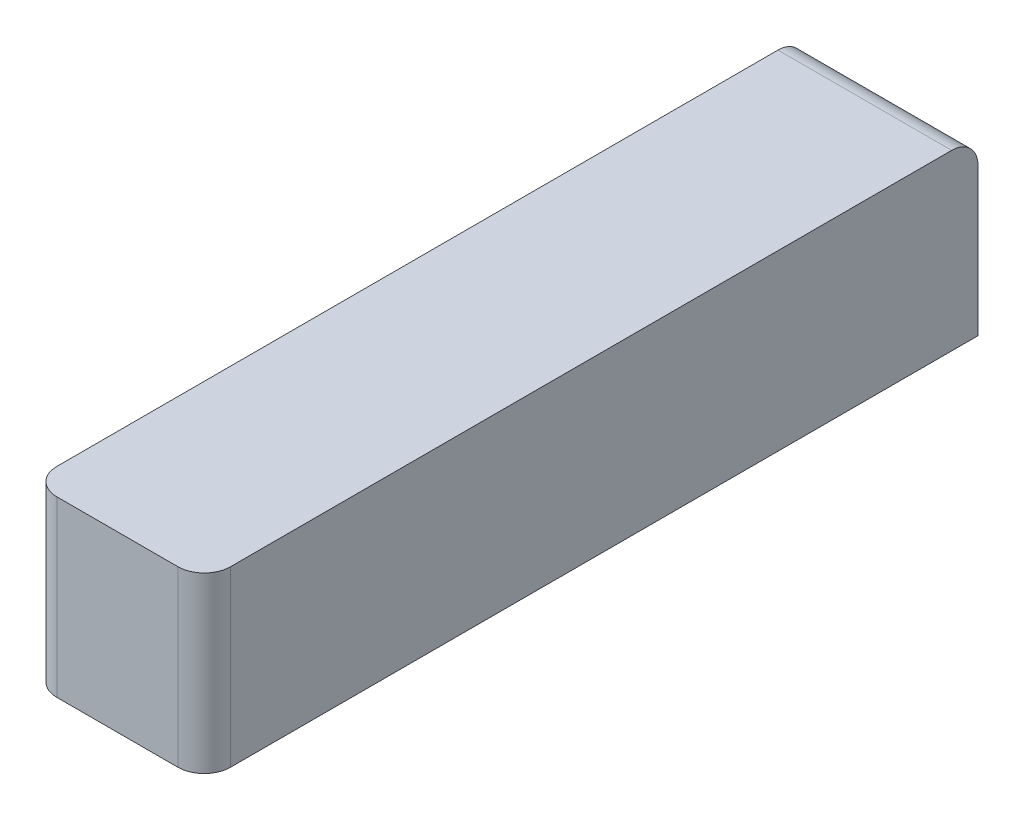
ISO-10303-21;
HEADER;
FILE_DESCRIPTION(('STEP AP214'),'2;1');
FILE_NAME('part.step','',(''),(''),'','','');
FILE_SCHEMA(('AUTOMOTIVE_DESIGN { 1 0 10303 214 1 1 1 1 }'));
ENDSEC;
DATA;
#1=APPLICATION_CONTEXT('core data for automotive mechanical design processes');
#2=APPLICATION_PROTOCOL_DEFINITION('international standard','automotive_design',2000,#1);
#3=PRODUCT_CONTEXT('',#1,'mechanical');
#4=PRODUCT('Part','Part','',(#3));
#5=PRODUCT_RELATED_PRODUCT_CATEGORY('part','',(#4));
#6=PRODUCT_DEFINITION_FORMATION('','',#4);
#7=PRODUCT_DEFINITION_CONTEXT('part definition',#1,'design');
#8=PRODUCT_DEFINITION('design','',#6,#7);
#9=PRODUCT_DEFINITION_SHAPE('','',#8);
#10=(LENGTH_UNIT() NAMED_UNIT(*) SI_UNIT(.MILLI.,.METRE.));
#11=(NAMED_UNIT(*) PLANE_ANGLE_UNIT() SI_UNIT($,.RADIAN.));
#12=(NAMED_UNIT(*) SI_UNIT($,.STERADIAN.) SOLID_ANGLE_UNIT());
#13=UNCERTAINTY_MEASURE_WITH_UNIT(LENGTH_MEASURE(1.E-05),#10,'distance_accuracy_value','');
#14=(GEOMETRIC_REPRESENTATION_CONTEXT(3) GLOBAL_UNCERTAINTY_ASSIGNED_CONTEXT((#13)) GLOBAL_UNIT_ASSIGNED_CONTEXT((#10,
#11,#12)) REPRESENTATION_CONTEXT('',''));
#15=CARTESIAN_POINT('',(0.,0.,0.));
#16=DIRECTION('',(0.,0.,1.));
#17=DIRECTION('',(1.,0.,0.));
#18=AXIS2_PLACEMENT_3D('',#15,#16,#17);
#19=CARTESIAN_POINT('',(16.5,33.,73.5));
#20=DIRECTION('',(-1.,0.,0.));
#21=DIRECTION('',(0.,0.,1.));
#22=AXIS2_PLACEMENT_3D('',#19,#20,#21);
#23=PLANE('',#22);
#24=DIRECTION('',(0.,-1.,0.));
#25=VECTOR('',#24,1.);
#26=CARTESIAN_POINT('',(16.5,33.,-73.5));
#27=LINE('',#26,#25);
#28=CARTESIAN_POINT('',(16.5,28.,-73.5));
#29=VERTEX_POINT('',#28);
#30=CARTESIAN_POINT('',(16.5,0.,-73.5));
#31=VERTEX_POINT('',#30);
#32=EDGE_CURVE('E97',#29,#31,#27,.T.);
#33=ORIENTED_EDGE('',*,*,#32,.F.);
#34=CARTESIAN_POINT('',(16.5,28.,-68.5));
#35=DIRECTION('',(-1.,0.,0.));
#36=DIRECTION('',(0.,0.,1.));
#37=AXIS2_PLACEMENT_3D('',#34,#35,#36);
#38=CIRCLE('',#37,5.);
#39=CARTESIAN_POINT('',(16.5,33.,-68.5));
#40=VERTEX_POINT('',#39);
#41=EDGE_CURVE('E139',#29,#40,#38,.F.);
#42=ORIENTED_EDGE('',*,*,#41,.T.);
#43=DIRECTION('',(0.,0.,-1.));
#44=VECTOR('',#43,1.);
#45=CARTESIAN_POINT('',(16.5,33.,73.5));
#46=LINE('',#45,#44);
#47=CARTESIAN_POINT('',(16.5,33.,68.5));
#48=VERTEX_POINT('',#47);
#49=EDGE_CURVE('E124',#48,#40,#46,.T.);
#50=ORIENTED_EDGE('',*,*,#49,.F.);
#51=DIRECTION('',(0.,-1.,0.));
#52=VECTOR('',#51,1.);
#53=CARTESIAN_POINT('',(16.5,33.,68.5));
#54=LINE('',#53,#52);
#55=CARTESIAN_POINT('',(16.5,0.,68.5));
#56=VERTEX_POINT('',#55);
#57=EDGE_CURVE('E101',#48,#56,#54,.T.);
#58=ORIENTED_EDGE('',*,*,#57,.T.);
#59=DIRECTION('',(0.,0.,-1.));
#60=VECTOR('',#59,1.);
#61=CARTESIAN_POINT('',(16.5,0.,73.5));
#62=LINE('',#61,#60);
#63=EDGE_CURVE('E95',#56,#31,#62,.T.);
#64=ORIENTED_EDGE('',*,*,#63,.T.);
#65=EDGE_LOOP('',(#33,#42,#50,#58,#64));
#66=FACE_BOUND('',#65,.T.);
#67=ADVANCED_FACE('F37',(#66),#23,.F.);
#68=CARTESIAN_POINT('',(-16.5,33.,-73.5));
#69=DIRECTION('',(0.,0.,1.));
#70=DIRECTION('',(1.,0.,0.));
#71=AXIS2_PLACEMENT_3D('',#68,#69,#70);
#72=PLANE('',#71);
#73=DIRECTION('',(0.,-1.,0.));
#74=VECTOR('',#73,1.);
#75=CARTESIAN_POINT('',(-16.5,33.,-73.5));
#76=LINE('',#75,#74);
#77=CARTESIAN_POINT('',(-16.5,28.,-73.5));
#78=VERTEX_POINT('',#77);
#79=CARTESIAN_POINT('',(-16.5,0.,-73.5));
#80=VERTEX_POINT('',#79);
#81=EDGE_CURVE('E113',#78,#80,#76,.T.);
#82=ORIENTED_EDGE('',*,*,#81,.F.);
#83=DIRECTION('',(-1.,0.,0.));
#84=VECTOR('',#83,1.);
#85=CARTESIAN_POINT('',(-16.5,28.,-73.5));
#86=LINE('',#85,#84);
#87=EDGE_CURVE('E111',#78,#29,#86,.F.);
#88=ORIENTED_EDGE('',*,*,#87,.T.);
#89=ORIENTED_EDGE('',*,*,#32,.T.);
#90=DIRECTION('',(-1.,0.,0.));
#91=VECTOR('',#90,1.);
#92=CARTESIAN_POINT('',(-16.5,0.,-73.5));
#93=LINE('',#92,#91);
#94=EDGE_CURVE('E103',#31,#80,#93,.T.);
#95=ORIENTED_EDGE('',*,*,#94,.T.);
#96=EDGE_LOOP('',(#82,#88,#89,#95));
#97=FACE_BOUND('',#96,.T.);
#98=ADVANCED_FACE('F108',(#97),#72,.F.);
#99=CARTESIAN_POINT('',(-16.5,33.,73.5));
#100=DIRECTION('',(1.,0.,0.));
#101=DIRECTION('',(0.,0.,-1.));
#102=AXIS2_PLACEMENT_3D('',#99,#100,#101);
#103=PLANE('',#102);
#104=DIRECTION('',(0.,0.,1.));
#105=VECTOR('',#104,1.);
#106=CARTESIAN_POINT('',(-16.5,33.,73.5));
#107=LINE('',#106,#105);
#108=CARTESIAN_POINT('',(-16.5,33.,-68.5));
#109=VERTEX_POINT('',#108);
#110=CARTESIAN_POINT('',(-16.5,33.,68.5));
#111=VERTEX_POINT('',#110);
#112=EDGE_CURVE('E159',#109,#111,#107,.T.);
#113=ORIENTED_EDGE('',*,*,#112,.F.);
#114=CARTESIAN_POINT('',(-16.5,28.,-68.5));
#115=DIRECTION('',(1.,0.,0.));
#116=DIRECTION('',(0.,0.,-1.));
#117=AXIS2_PLACEMENT_3D('',#114,#115,#116);
#118=CIRCLE('',#117,5.);
#119=EDGE_CURVE('E135',#109,#78,#118,.F.);
#120=ORIENTED_EDGE('',*,*,#119,.T.);
#121=ORIENTED_EDGE('',*,*,#81,.T.);
#122=DIRECTION('',(0.,0.,1.));
#123=VECTOR('',#122,1.);
#124=CARTESIAN_POINT('',(-16.5,0.,73.5));
#125=LINE('',#124,#123);
#126=CARTESIAN_POINT('',(-16.5,0.,68.5));
#127=VERTEX_POINT('',#126);
#128=EDGE_CURVE('E117',#80,#127,#125,.T.);
#129=ORIENTED_EDGE('',*,*,#128,.T.);
#130=DIRECTION('',(0.,-1.,0.));
#131=VECTOR('',#130,1.);
#132=CARTESIAN_POINT('',(-16.5,33.,68.5));
#133=LINE('',#132,#131);
#134=EDGE_CURVE('E133',#127,#111,#133,.F.);
#135=ORIENTED_EDGE('',*,*,#134,.T.);
#136=EDGE_LOOP('',(#113,#120,#121,#129,#135));
#137=FACE_BOUND('',#136,.T.);
#138=ADVANCED_FACE('F152',(#137),#103,.F.);
#139=CARTESIAN_POINT('',(-16.5,33.,73.5));
#140=DIRECTION('',(0.,0.,-1.));
#141=DIRECTION('',(-1.,0.,0.));
#142=AXIS2_PLACEMENT_3D('',#139,#140,#141);
#143=PLANE('',#142);
#144=DIRECTION('',(1.,0.,0.));
#145=VECTOR('',#144,1.);
#146=CARTESIAN_POINT('',(-16.5,33.,73.5));
#147=LINE('',#146,#145);
#148=CARTESIAN_POINT('',(-11.5,33.,73.5));
#149=VERTEX_POINT('',#148);
#150=CARTESIAN_POINT('',(11.5,33.,73.5));
#151=VERTEX_POINT('',#150);
#152=EDGE_CURVE('E125',#149,#151,#147,.T.);
#153=ORIENTED_EDGE('',*,*,#152,.F.);
#154=DIRECTION('',(0.,-1.,0.));
#155=VECTOR('',#154,1.);
#156=CARTESIAN_POINT('',(-11.5,33.,73.5));
#157=LINE('',#156,#155);
#158=CARTESIAN_POINT('',(-11.5,0.,73.5));
#159=VERTEX_POINT('',#158);
#160=EDGE_CURVE('E143',#149,#159,#157,.T.);
#161=ORIENTED_EDGE('',*,*,#160,.T.);
#162=DIRECTION('',(1.,0.,0.));
#163=VECTOR('',#162,1.);
#164=CARTESIAN_POINT('',(-16.5,0.,73.5));
#165=LINE('',#164,#163);
#166=CARTESIAN_POINT('',(11.5,0.,73.5));
#167=VERTEX_POINT('',#166);
#168=EDGE_CURVE('E119',#159,#167,#165,.T.);
#169=ORIENTED_EDGE('',*,*,#168,.T.);
#170=DIRECTION('',(0.,-1.,0.));
#171=VECTOR('',#170,1.);
#172=CARTESIAN_POINT('',(11.5,33.,73.5));
#173=LINE('',#172,#171);
#174=EDGE_CURVE('E141',#167,#151,#173,.F.);
#175=ORIENTED_EDGE('',*,*,#174,.T.);
#176=EDGE_LOOP('',(#153,#161,#169,#175));
#177=FACE_BOUND('',#176,.T.);
#178=ADVANCED_FACE('F146',(#177),#143,.F.);
#179=CARTESIAN_POINT('',(0.,33.,0.));
#180=DIRECTION('',(0.,-1.,0.));
#181=DIRECTION('',(0.,0.,-1.));
#182=AXIS2_PLACEMENT_3D('',#179,#180,#181);
#183=PLANE('',#182);
#184=ORIENTED_EDGE('',*,*,#49,.T.);
#185=DIRECTION('',(-1.,0.,0.));
#186=VECTOR('',#185,1.);
#187=CARTESIAN_POINT('',(0.,33.,-68.5));
#188=LINE('',#187,#186);
#189=EDGE_CURVE('E130',#40,#109,#188,.T.);
#190=ORIENTED_EDGE('',*,*,#189,.T.);
#191=ORIENTED_EDGE('',*,*,#112,.T.);
#192=CARTESIAN_POINT('',(-11.5,33.,68.5));
#193=DIRECTION('',(0.,-1.,0.));
#194=DIRECTION('',(0.,0.,-1.));
#195=AXIS2_PLACEMENT_3D('',#192,#193,#194);
#196=CIRCLE('',#195,5.);
#197=EDGE_CURVE('E128',#111,#149,#196,.F.);
#198=ORIENTED_EDGE('',*,*,#197,.T.);
#199=ORIENTED_EDGE('',*,*,#152,.T.);
#200=CARTESIAN_POINT('',(11.5,33.,68.5));
#201=DIRECTION('',(0.,-1.,0.));
#202=DIRECTION('',(0.,0.,-1.));
#203=AXIS2_PLACEMENT_3D('',#200,#201,#202);
#204=CIRCLE('',#203,5.);
#205=EDGE_CURVE('E112',#151,#48,#204,.F.);
#206=ORIENTED_EDGE('',*,*,#205,.T.);
#207=EDGE_LOOP('',(#184,#190,#191,#198,#199,#206));
#208=FACE_BOUND('',#207,.T.);
#209=ADVANCED_FACE('F157',(#208),#183,.F.);
#210=CARTESIAN_POINT('',(0.,0.,0.));
#211=DIRECTION('',(0.,-1.,0.));
#212=DIRECTION('',(0.,0.,-1.));
#213=AXIS2_PLACEMENT_3D('',#210,#211,#212);
#214=PLANE('',#213);
#215=ORIENTED_EDGE('',*,*,#168,.F.);
#216=CARTESIAN_POINT('',(-11.5,0.,68.5));
#217=DIRECTION('',(0.,-1.,0.));
#218=DIRECTION('',(0.,0.,-1.));
#219=AXIS2_PLACEMENT_3D('',#216,#217,#218);
#220=CIRCLE('',#219,5.);
#221=EDGE_CURVE('E11',#159,#127,#220,.T.);
#222=ORIENTED_EDGE('',*,*,#221,.T.);
#223=ORIENTED_EDGE('',*,*,#128,.F.);
#224=ORIENTED_EDGE('',*,*,#94,.F.);
#225=ORIENTED_EDGE('',*,*,#63,.F.);
#226=CARTESIAN_POINT('',(11.5,0.,68.5));
#227=DIRECTION('',(0.,-1.,0.));
#228=DIRECTION('',(0.,0.,-1.));
#229=AXIS2_PLACEMENT_3D('',#226,#227,#228);
#230=CIRCLE('',#229,5.);
#231=EDGE_CURVE('E45',#56,#167,#230,.T.);
#232=ORIENTED_EDGE('',*,*,#231,.T.);
#233=EDGE_LOOP('',(#215,#222,#223,#224,#225,#232));
#234=FACE_BOUND('',#233,.T.);
#235=ADVANCED_FACE('F115',(#234),#214,.T.);
#236=CARTESIAN_POINT('',(0.,28.,-68.5));
#237=DIRECTION('',(-1.,0.,0.));
#238=DIRECTION('',(0.,0.,1.));
#239=AXIS2_PLACEMENT_3D('',#236,#237,#238);
#240=CYLINDRICAL_SURFACE('',#239,5.);
#241=ORIENTED_EDGE('',*,*,#41,.F.);
#242=ORIENTED_EDGE('',*,*,#87,.F.);
#243=ORIENTED_EDGE('',*,*,#119,.F.);
#244=ORIENTED_EDGE('',*,*,#189,.F.);
#245=EDGE_LOOP('',(#241,#242,#243,#244));
#246=FACE_BOUND('',#245,.T.);
#247=ADVANCED_FACE('F164',(#246),#240,.T.);
#248=CARTESIAN_POINT('',(-11.5,33.,68.5));
#249=DIRECTION('',(0.,-1.,0.));
#250=DIRECTION('',(0.,0.,-1.));
#251=AXIS2_PLACEMENT_3D('',#248,#249,#250);
#252=CYLINDRICAL_SURFACE('',#251,5.);
#253=ORIENTED_EDGE('',*,*,#197,.F.);
#254=ORIENTED_EDGE('',*,*,#134,.F.);
#255=ORIENTED_EDGE('',*,*,#221,.F.);
#256=ORIENTED_EDGE('',*,*,#160,.F.);
#257=EDGE_LOOP('',(#253,#254,#255,#256));
#258=FACE_BOUND('',#257,.T.);
#259=ADVANCED_FACE('F154',(#258),#252,.T.);
#260=CARTESIAN_POINT('',(11.5,33.,68.5));
#261=DIRECTION('',(0.,-1.,0.));
#262=DIRECTION('',(0.,0.,-1.));
#263=AXIS2_PLACEMENT_3D('',#260,#261,#262);
#264=CYLINDRICAL_SURFACE('',#263,5.);
#265=ORIENTED_EDGE('',*,*,#205,.F.);
#266=ORIENTED_EDGE('',*,*,#174,.F.);
#267=ORIENTED_EDGE('',*,*,#231,.F.);
#268=ORIENTED_EDGE('',*,*,#57,.F.);
#269=EDGE_LOOP('',(#265,#266,#267,#268));
#270=FACE_BOUND('',#269,.T.);
#271=ADVANCED_FACE('F39',(#270),#264,.T.);
#272=CLOSED_SHELL('',(#67,#98,#138,#178,#209,#235,#247,#259,#271));
#273=MANIFOLD_SOLID_BREP('B2',#272);
#274=ADVANCED_BREP_SHAPE_REPRESENTATION('',(#18,#273),#14);
#275=SHAPE_DEFINITION_REPRESENTATION(#9,#274);
ENDSEC;
END-ISO-10303-21;
